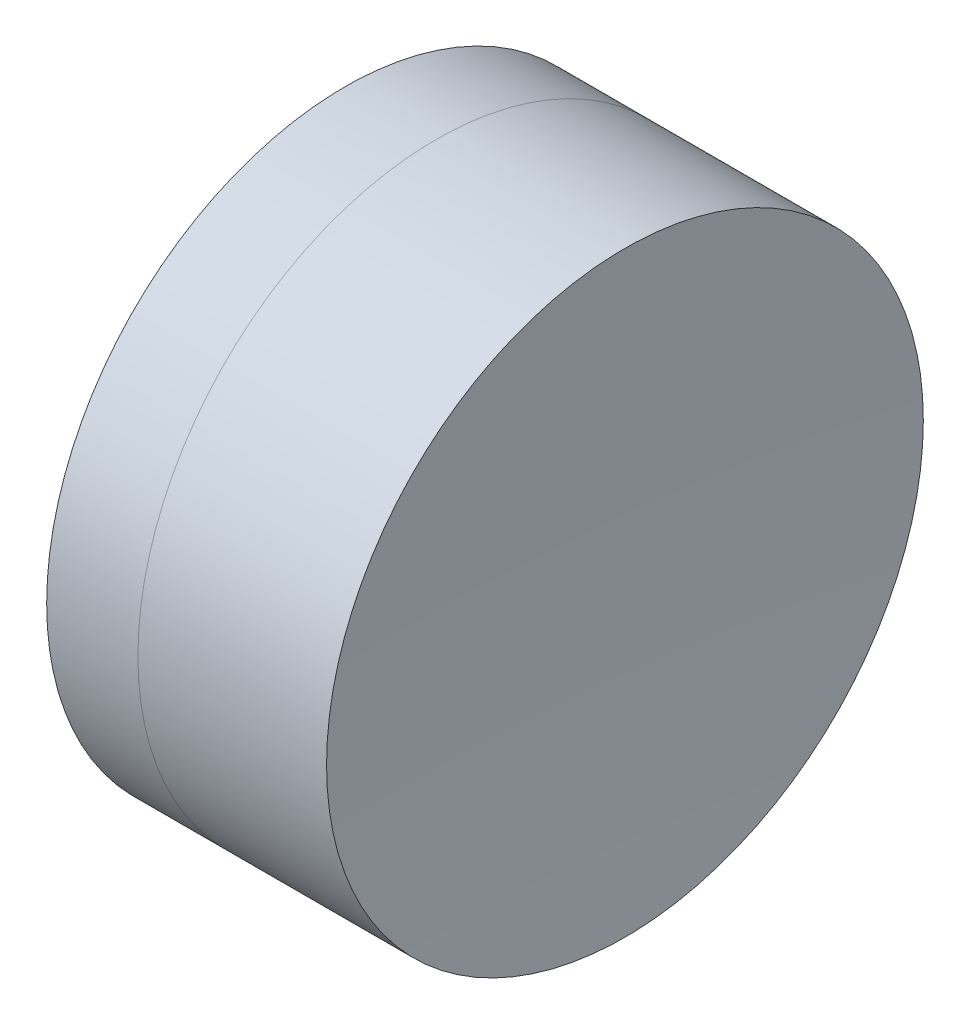
ISO-10303-21;
HEADER;
FILE_DESCRIPTION(('STEP AP214'),'2;1');
FILE_NAME('part.step','',(''),(''),'','','');
FILE_SCHEMA(('AUTOMOTIVE_DESIGN { 1 0 10303 214 1 1 1 1 }'));
ENDSEC;
DATA;
#1=APPLICATION_CONTEXT('core data for automotive mechanical design processes');
#2=APPLICATION_PROTOCOL_DEFINITION('international standard','automotive_design',2000,#1);
#3=PRODUCT_CONTEXT('',#1,'mechanical');
#4=PRODUCT('Part','Part','',(#3));
#5=PRODUCT_RELATED_PRODUCT_CATEGORY('part','',(#4));
#6=PRODUCT_DEFINITION_FORMATION('','',#4);
#7=PRODUCT_DEFINITION_CONTEXT('part definition',#1,'design');
#8=PRODUCT_DEFINITION('design','',#6,#7);
#9=PRODUCT_DEFINITION_SHAPE('','',#8);
#10=(LENGTH_UNIT() NAMED_UNIT(*) SI_UNIT(.MILLI.,.METRE.));
#11=(NAMED_UNIT(*) PLANE_ANGLE_UNIT() SI_UNIT($,.RADIAN.));
#12=(NAMED_UNIT(*) SI_UNIT($,.STERADIAN.) SOLID_ANGLE_UNIT());
#13=UNCERTAINTY_MEASURE_WITH_UNIT(LENGTH_MEASURE(1.E-05),#10,'distance_accuracy_value','');
#14=(GEOMETRIC_REPRESENTATION_CONTEXT(3) GLOBAL_UNCERTAINTY_ASSIGNED_CONTEXT((#13)) GLOBAL_UNIT_ASSIGNED_CONTEXT((#10,
#11,#12)) REPRESENTATION_CONTEXT('',''));
#15=CARTESIAN_POINT('',(0.,0.,0.));
#16=DIRECTION('',(0.,0.,1.));
#17=DIRECTION('',(1.,0.,0.));
#18=AXIS2_PLACEMENT_3D('',#15,#16,#17);
#19=CARTESIAN_POINT('',(16.4612599031566,0.,0.));
#20=DIRECTION('',(-1.,0.,0.));
#21=DIRECTION('',(0.,0.,-1.));
#22=AXIS2_PLACEMENT_3D('',#19,#20,#21);
#23=SPHERICAL_SURFACE('',#22,7.75);
#24=CARTESIAN_POINT('',(23.0992189268324,0.,0.));
#25=DIRECTION('',(-1.,0.,0.));
#26=DIRECTION('',(0.,0.,1.));
#27=AXIS2_PLACEMENT_3D('',#24,#25,#26);
#28=CIRCLE('',#27,4.);
#29=CARTESIAN_POINT('',(23.0992189268324,0.,4.));
#30=VERTEX_POINT('',#29);
#31=EDGE_CURVE('E51',#30,#30,#28,.T.);
#32=ORIENTED_EDGE('',*,*,#31,.T.);
#33=EDGE_LOOP('',(#32));
#34=FACE_BOUND('',#33,.T.);
#35=ADVANCED_FACE('F45',(#34),#23,.F.);
#36=CARTESIAN_POINT('',(94.0512599031566,0.,0.));
#37=DIRECTION('',(-1.,0.,0.));
#38=DIRECTION('',(0.,0.,-1.));
#39=AXIS2_PLACEMENT_3D('',#36,#37,#38);
#40=SPHERICAL_SURFACE('',#39,68.54);
#41=CARTESIAN_POINT('',(25.6280796204483,0.,0.));
#42=DIRECTION('',(-1.,0.,0.));
#43=DIRECTION('',(0.,0.,1.));
#44=AXIS2_PLACEMENT_3D('',#41,#42,#43);
#45=CIRCLE('',#44,4.);
#46=CARTESIAN_POINT('',(25.6280796204483,0.,4.));
#47=VERTEX_POINT('',#46);
#48=EDGE_CURVE('E11',#47,#47,#45,.T.);
#49=ORIENTED_EDGE('',*,*,#48,.F.);
#50=EDGE_LOOP('',(#49));
#51=FACE_BOUND('',#50,.T.);
#52=ADVANCED_FACE('F60',(#51),#40,.F.);
#53=CARTESIAN_POINT('',(-0.551919992657797,0.,0.));
#54=DIRECTION('',(-1.,0.,0.));
#55=DIRECTION('',(0.,0.,1.));
#56=AXIS2_PLACEMENT_3D('',#53,#54,#55);
#57=CYLINDRICAL_SURFACE('',#56,4.);
#58=ORIENTED_EDGE('',*,*,#48,.T.);
#59=EDGE_LOOP('',(#58));
#60=FACE_BOUND('',#59,.T.);
#61=ORIENTED_EDGE('',*,*,#31,.F.);
#62=EDGE_LOOP('',(#61));
#63=FACE_BOUND('',#62,.T.);
#64=ADVANCED_FACE('F58',(#60,#63),#57,.T.);
#65=CLOSED_SHELL('',(#35,#52,#64));
#66=MANIFOLD_SOLID_BREP('B2',#65);
#67=CARTESIAN_POINT('',(28.1612599031566,0.,0.));
#68=DIRECTION('',(-1.,0.,0.));
#69=DIRECTION('',(0.,0.,-1.));
#70=AXIS2_PLACEMENT_3D('',#67,#68,#69);
#71=SPHERICAL_SURFACE('',#70,7.45);
#72=CARTESIAN_POINT('',(21.8761584719941,0.,0.));
#73=DIRECTION('',(-1.,0.,0.));
#74=DIRECTION('',(0.,0.,1.));
#75=AXIS2_PLACEMENT_3D('',#72,#73,#74);
#76=CIRCLE('',#75,4.);
#77=CARTESIAN_POINT('',(21.8761584719941,0.,4.));
#78=VERTEX_POINT('',#77);
#79=EDGE_CURVE('E44',#78,#78,#76,.T.);
#80=ORIENTED_EDGE('',*,*,#79,.T.);
#81=EDGE_LOOP('',(#80));
#82=FACE_BOUND('',#81,.T.);
#83=ADVANCED_FACE('F86',(#82),#71,.T.);
#84=CARTESIAN_POINT('',(-0.816062176165804,0.,0.));
#85=DIRECTION('',(-1.,0.,0.));
#86=DIRECTION('',(0.,0.,1.));
#87=AXIS2_PLACEMENT_3D('',#84,#85,#86);
#88=CYLINDRICAL_SURFACE('',#87,4.);
#89=CARTESIAN_POINT('',(23.0992189268324,0.,0.));
#90=DIRECTION('',(-1.,0.,0.));
#91=DIRECTION('',(0.,0.,1.));
#92=AXIS2_PLACEMENT_3D('',#89,#90,#91);
#93=CIRCLE('',#92,4.);
#94=CARTESIAN_POINT('',(23.0992189268324,0.,4.));
#95=VERTEX_POINT('',#94);
#96=EDGE_CURVE('E92',#95,#95,#93,.T.);
#97=ORIENTED_EDGE('',*,*,#96,.T.);
#98=EDGE_LOOP('',(#97));
#99=FACE_BOUND('',#98,.T.);
#100=ORIENTED_EDGE('',*,*,#79,.F.);
#101=EDGE_LOOP('',(#100));
#102=FACE_BOUND('',#101,.T.);
#103=ADVANCED_FACE('F98',(#99,#102),#88,.T.);
#104=CARTESIAN_POINT('',(16.4612599031566,0.,0.));
#105=DIRECTION('',(-1.,0.,0.));
#106=DIRECTION('',(0.,0.,1.));
#107=AXIS2_PLACEMENT_3D('',#104,#105,#106);
#108=SPHERICAL_SURFACE('',#107,7.75);
#109=ORIENTED_EDGE('',*,*,#96,.F.);
#110=EDGE_LOOP('',(#109));
#111=FACE_BOUND('',#110,.T.);
#112=ADVANCED_FACE('F101',(#111),#108,.T.);
#113=CLOSED_SHELL('',(#83,#103,#112));
#114=MANIFOLD_SOLID_BREP('B6',#113);
#115=ADVANCED_BREP_SHAPE_REPRESENTATION('',(#18,#66,#114),#14);
#116=SHAPE_DEFINITION_REPRESENTATION(#9,#115);
ENDSEC;
END-ISO-10303-21;
